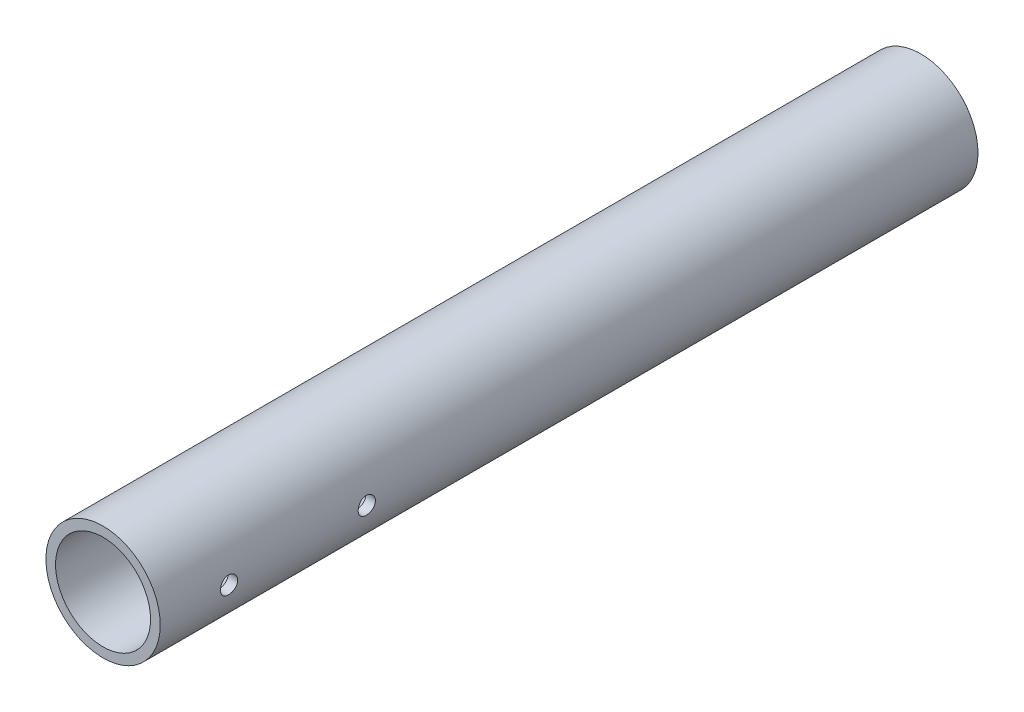
ISO-10303-21;
HEADER;
FILE_DESCRIPTION(('STEP AP214'),'2;1');
FILE_NAME('part.step','',(''),(''),'','','');
FILE_SCHEMA(('AUTOMOTIVE_DESIGN { 1 0 10303 214 1 1 1 1 }'));
ENDSEC;
DATA;
#1=APPLICATION_CONTEXT('core data for automotive mechanical design processes');
#2=APPLICATION_PROTOCOL_DEFINITION('international standard','automotive_design',2000,#1);
#3=PRODUCT_CONTEXT('',#1,'mechanical');
#4=PRODUCT('Part','Part','',(#3));
#5=PRODUCT_RELATED_PRODUCT_CATEGORY('part','',(#4));
#6=PRODUCT_DEFINITION_FORMATION('','',#4);
#7=PRODUCT_DEFINITION_CONTEXT('part definition',#1,'design');
#8=PRODUCT_DEFINITION('design','',#6,#7);
#9=PRODUCT_DEFINITION_SHAPE('','',#8);
#10=(LENGTH_UNIT() NAMED_UNIT(*) SI_UNIT(.MILLI.,.METRE.));
#11=(NAMED_UNIT(*) PLANE_ANGLE_UNIT() SI_UNIT($,.RADIAN.));
#12=(NAMED_UNIT(*) SI_UNIT($,.STERADIAN.) SOLID_ANGLE_UNIT());
#13=UNCERTAINTY_MEASURE_WITH_UNIT(LENGTH_MEASURE(1.E-05),#10,'distance_accuracy_value','');
#14=(GEOMETRIC_REPRESENTATION_CONTEXT(3) GLOBAL_UNCERTAINTY_ASSIGNED_CONTEXT((#13)) GLOBAL_UNIT_ASSIGNED_CONTEXT((#10,
#11,#12)) REPRESENTATION_CONTEXT('',''));
#15=CARTESIAN_POINT('',(0.,0.,0.));
#16=DIRECTION('',(0.,0.,1.));
#17=DIRECTION('',(1.,0.,0.));
#18=AXIS2_PLACEMENT_3D('',#15,#16,#17);
#19=CARTESIAN_POINT('',(0.,0.,0.));
#20=DIRECTION('',(0.,0.,1.));
#21=DIRECTION('',(1.,0.,0.));
#22=AXIS2_PLACEMENT_3D('',#19,#20,#21);
#23=CYLINDRICAL_SURFACE('',#22,17.526);
#24=CARTESIAN_POINT('',(0.,0.,301.625));
#25=DIRECTION('',(0.,0.,1.));
#26=DIRECTION('',(1.,0.,0.));
#27=AXIS2_PLACEMENT_3D('',#24,#25,#26);
#28=CIRCLE('',#27,17.526);
#29=CARTESIAN_POINT('',(17.526,0.,301.625));
#30=VERTEX_POINT('',#29);
#31=EDGE_CURVE('E19',#30,#30,#28,.F.);
#32=ORIENTED_EDGE('',*,*,#31,.F.);
#33=EDGE_LOOP('',(#32));
#34=FACE_BOUND('',#33,.T.);
#35=CARTESIAN_POINT('',(0.,0.,0.));
#36=DIRECTION('',(0.,0.,1.));
#37=DIRECTION('',(1.,0.,0.));
#38=AXIS2_PLACEMENT_3D('',#35,#36,#37);
#39=CIRCLE('',#38,17.526);
#40=CARTESIAN_POINT('',(17.526,0.,0.));
#41=VERTEX_POINT('',#40);
#42=EDGE_CURVE('E79',#41,#41,#39,.F.);
#43=ORIENTED_EDGE('',*,*,#42,.T.);
#44=EDGE_LOOP('',(#43));
#45=FACE_BOUND('',#44,.T.);
#46=CARTESIAN_POINT('',(17.526,0.,228.6));
#47=CARTESIAN_POINT('',(17.5259963175726,-0.176613181051219,228.599991723302));
#48=CARTESIAN_POINT('',(17.5233002826582,-0.353449171258822,228.585200668148));
#49=CARTESIAN_POINT('',(17.5127973362593,-0.702281908474058,228.526423100833));
#50=CARTESIAN_POINT('',(17.5049801575711,-0.874268208471729,228.482377935658));
#51=CARTESIAN_POINT('',(17.48511038614,-1.20810250721724,228.36647464681));
#52=CARTESIAN_POINT('',(17.473063368271,-1.36996352173553,228.294653119444));
#53=CARTESIAN_POINT('',(17.4460554580361,-1.67927316437238,228.125324943954));
#54=CARTESIAN_POINT('',(17.4310956012814,-1.82672688686375,228.027827420172));
#55=CARTESIAN_POINT('',(17.3997238299546,-2.10477719057218,227.808732397024));
#56=CARTESIAN_POINT('',(17.3832987194985,-2.23518750324315,227.686900352404));
#57=CARTESIAN_POINT('',(17.3509459564745,-2.4738411468331,227.42309368207));
#58=CARTESIAN_POINT('',(17.335018364459,-2.58208178835294,227.281116616098));
#59=CARTESIAN_POINT('',(17.3053385875312,-2.77407123838613,226.979766903282));
#60=CARTESIAN_POINT('',(17.2916032051447,-2.85763469507356,226.820274368621));
#61=CARTESIAN_POINT('',(17.2680458993697,-2.99671051245856,226.489226026226));
#62=CARTESIAN_POINT('',(17.2582236283197,-3.05222536525873,226.317671291755));
#63=CARTESIAN_POINT('',(17.2437354897132,-3.13304106760211,225.969333560972));
#64=CARTESIAN_POINT('',(17.2390149777777,-3.15866234519934,225.792627222411));
#65=CARTESIAN_POINT('',(17.2350999262051,-3.17995782709564,225.437365293601));
#66=CARTESIAN_POINT('',(17.2359049331653,-3.17563448853508,225.258809856282));
#67=CARTESIAN_POINT('',(17.2429001543548,-3.1374237379337,224.907230746528));
#68=CARTESIAN_POINT('',(17.2490242048828,-3.10389954139064,224.734166088615));
#69=CARTESIAN_POINT('',(17.2658637551246,-3.00880960849843,224.396157532169));
#70=CARTESIAN_POINT('',(17.276579474651,-2.94724252966899,224.231214022834));
#71=CARTESIAN_POINT('',(17.3014652665684,-2.79745291276664,223.913055892979));
#72=CARTESIAN_POINT('',(17.3156545368537,-2.70908155858375,223.759912899375));
#73=CARTESIAN_POINT('',(17.3458743890737,-2.50830442996258,223.470503775616));
#74=CARTESIAN_POINT('',(17.3619050065012,-2.39589819220294,223.334237970883));
#75=CARTESIAN_POINT('',(17.3942883351767,-2.1482992811474,223.080361728415));
#76=CARTESIAN_POINT('',(17.4106423451863,-2.01279967929527,222.963050627084));
#77=CARTESIAN_POINT('',(17.4416233292778,-1.72381393754222,222.752729015706));
#78=CARTESIAN_POINT('',(17.4562495353168,-1.57031985869495,222.65972929043));
#79=CARTESIAN_POINT('',(17.4821550853628,-1.24935860544025,222.50063859958));
#80=CARTESIAN_POINT('',(17.4934280108005,-1.08186540977742,222.434599150311));
#81=CARTESIAN_POINT('',(17.5112904348231,-0.738132155126084,222.331807400917));
#82=CARTESIAN_POINT('',(17.5178897862262,-0.561911340494511,222.294993467668));
#83=CARTESIAN_POINT('',(17.5231896350432,-0.320322833927912,222.265545032544));
#84=CARTESIAN_POINT('',(17.5242412276541,-0.256410066392401,222.259720466382));
#85=CARTESIAN_POINT('',(17.5256470796399,-0.128341342038199,222.251946444097));
#86=CARTESIAN_POINT('',(17.5260013382808,-0.0641853849635993,222.249996992053));
#87=CARTESIAN_POINT('',(17.5259963175725,0.176613181051216,222.250008276698));
#88=CARTESIAN_POINT('',(17.5233002826582,0.35344917125882,222.264799331852));
#89=CARTESIAN_POINT('',(17.5127973362593,0.702281908474057,222.323576899167));
#90=CARTESIAN_POINT('',(17.5049801575711,0.874268208471726,222.367622064342));
#91=CARTESIAN_POINT('',(17.48511038614,1.20810250721724,222.48352535319));
#92=CARTESIAN_POINT('',(17.473063368271,1.36996352173553,222.555346880556));
#93=CARTESIAN_POINT('',(17.4460554580361,1.67927316437238,222.724675056046));
#94=CARTESIAN_POINT('',(17.4310956012814,1.82672688686375,222.822172579828));
#95=CARTESIAN_POINT('',(17.3997238299546,2.10477719057218,223.041267602976));
#96=CARTESIAN_POINT('',(17.3832987194985,2.23518750324315,223.163099647596));
#97=CARTESIAN_POINT('',(17.3509459564745,2.4738411468331,223.42690631793));
#98=CARTESIAN_POINT('',(17.335018364459,2.58208178835294,223.568883383902));
#99=CARTESIAN_POINT('',(17.3053385875312,2.77407123838613,223.870233096717));
#100=CARTESIAN_POINT('',(17.2916032051447,2.85763469507356,224.029725631379));
#101=CARTESIAN_POINT('',(17.2680458993697,2.99671051245856,224.360773973774));
#102=CARTESIAN_POINT('',(17.2582236283197,3.05222536525873,224.532328708245));
#103=CARTESIAN_POINT('',(17.2437354897132,3.13304106760212,224.880666439028));
#104=CARTESIAN_POINT('',(17.2390149777777,3.15866234519934,225.057372777589));
#105=CARTESIAN_POINT('',(17.2350999262051,3.17995782709564,225.412634706399));
#106=CARTESIAN_POINT('',(17.2359049331653,3.17563448853508,225.591190143718));
#107=CARTESIAN_POINT('',(17.2429001543548,3.1374237379337,225.942769253472));
#108=CARTESIAN_POINT('',(17.2490242048828,3.10389954139064,226.115833911385));
#109=CARTESIAN_POINT('',(17.2658637551246,3.00880960849843,226.453842467831));
#110=CARTESIAN_POINT('',(17.276579474651,2.94724252966899,226.618785977166));
#111=CARTESIAN_POINT('',(17.3014652665683,2.79745291276665,226.936944107021));
#112=CARTESIAN_POINT('',(17.3156545368537,2.70908155858377,227.090087100625));
#113=CARTESIAN_POINT('',(17.3458743890737,2.50830442996262,227.379496224384));
#114=CARTESIAN_POINT('',(17.3619050065012,2.39589819220297,227.515762029117));
#115=CARTESIAN_POINT('',(17.3942883351767,2.14829928114741,227.769638271585));
#116=CARTESIAN_POINT('',(17.4106423451863,2.01279967929527,227.886949372916));
#117=CARTESIAN_POINT('',(17.4416233292778,1.72381393754221,228.097270984294));
#118=CARTESIAN_POINT('',(17.4562495353168,1.57031985869494,228.19027070957));
#119=CARTESIAN_POINT('',(17.4821550853628,1.24935860544024,228.34936140042));
#120=CARTESIAN_POINT('',(17.4934280108005,1.08186540977741,228.415400849689));
#121=CARTESIAN_POINT('',(17.5112904348231,0.738132155126082,228.518192599083));
#122=CARTESIAN_POINT('',(17.5178897862262,0.56191134049451,228.555006532332));
#123=CARTESIAN_POINT('',(17.5231896350432,0.320322833927913,228.584454967456));
#124=CARTESIAN_POINT('',(17.5242412276541,0.256410066392403,228.590279533618));
#125=CARTESIAN_POINT('',(17.5256470796399,0.128341342038199,228.598053555903));
#126=CARTESIAN_POINT('',(17.5260013382808,0.064185384963597,228.600003007947));
#127=CARTESIAN_POINT('',(17.526,0.,228.6));
#128=B_SPLINE_CURVE_WITH_KNOTS('',3,(#46,#47,#48,#49,#50,#51,#52,#53,#54,#55,#56,#57,#58,#59,
#60,#61,#62,#63,#64,#65,#66,#67,#68,#69,#70,#71,#72,#73,#74,#75,#76,#77,#78,#79,#80,#81,#82,#83,
#84,#85,#86,#87,#88,#89,#90,#91,#92,#93,#94,#95,#96,#97,#98,#99,#100,#101,#102,#103,#104,#105,
#106,#107,#108,#109,#110,#111,#112,#113,#114,#115,#116,#117,#118,#119,#120,#121,#122,#123,#124,
#125,#126,#127),.UNSPECIFIED.,.T.,.F.,(4,2,2,2,2,2,2,2,2,2,2,2,2,2,2,2,2,2,2,2,2,2,2,2,2,2,2,2,
2,2,2,2,2,2,2,2,2,2,2,2,4),(0.,0.529594384353563,1.06025379692028,1.59021641642846,
2.11999095947089,2.65514211392808,3.19035814908344,3.72949754433928,4.26858902893713,
4.80184732449043,5.33506186343175,5.86173721299806,6.38843777843187,6.91811781643,
7.44780806601112,7.98518312810166,8.52279617220151,9.06143174460419,9.59892835876538,
9.79139521459188,9.98386227300716,10.5134566573607,11.0441160699274,11.5740786894356,
12.103853232478,12.6390043869352,13.1742204220906,13.7133598173464,14.2524513019443,
14.7857095974976,15.3189241364389,15.8455994860052,16.372300051439,16.9019800894371,
17.4316703390183,17.9690454011088,18.5066584452087,19.0452940176114,19.5827906317725,
19.775257487599,19.9677245460143),.UNSPECIFIED.);
#129=CARTESIAN_POINT('',(17.526,0.,228.6));
#130=VERTEX_POINT('',#129);
#131=EDGE_CURVE('E73',#130,#130,#128,.T.);
#132=ORIENTED_EDGE('',*,*,#131,.T.);
#133=EDGE_LOOP('',(#132));
#134=FACE_BOUND('',#133,.T.);
#135=CARTESIAN_POINT('',(17.526,0.,279.4));
#136=CARTESIAN_POINT('',(17.5259963175726,-0.176613181051217,279.399991723302));
#137=CARTESIAN_POINT('',(17.5233002826582,-0.353449171258817,279.385200668148));
#138=CARTESIAN_POINT('',(17.5127973362593,-0.702281908474051,279.326423100833));
#139=CARTESIAN_POINT('',(17.5049801575711,-0.874268208471723,279.282377935658));
#140=CARTESIAN_POINT('',(17.48511038614,-1.20810250721723,279.16647464681));
#141=CARTESIAN_POINT('',(17.473063368271,-1.36996352173552,279.094653119444));
#142=CARTESIAN_POINT('',(17.4460554580361,-1.67927316437237,278.925324943954));
#143=CARTESIAN_POINT('',(17.4310956012814,-1.82672688686375,278.827827420172));
#144=CARTESIAN_POINT('',(17.3997238299546,-2.10477719057218,278.608732397024));
#145=CARTESIAN_POINT('',(17.3832987194985,-2.23518750324315,278.486900352404));
#146=CARTESIAN_POINT('',(17.3509459564745,-2.4738411468331,278.22309368207));
#147=CARTESIAN_POINT('',(17.335018364459,-2.58208178835293,278.081116616098));
#148=CARTESIAN_POINT('',(17.3053385875312,-2.77407123838613,277.779766903283));
#149=CARTESIAN_POINT('',(17.2916032051447,-2.85763469507356,277.620274368621));
#150=CARTESIAN_POINT('',(17.2680458993697,-2.99671051245855,277.289226026226));
#151=CARTESIAN_POINT('',(17.2582236283197,-3.05222536525872,277.117671291755));
#152=CARTESIAN_POINT('',(17.2437354897132,-3.13304106760211,276.769333560972));
#153=CARTESIAN_POINT('',(17.2390149777777,-3.15866234519934,276.592627222411));
#154=CARTESIAN_POINT('',(17.2350999262051,-3.17995782709565,276.237365293601));
#155=CARTESIAN_POINT('',(17.2359049331653,-3.17563448853508,276.058809856282));
#156=CARTESIAN_POINT('',(17.2429001543548,-3.13742373793371,275.707230746528));
#157=CARTESIAN_POINT('',(17.2490242048828,-3.10389954139064,275.534166088615));
#158=CARTESIAN_POINT('',(17.2658637551246,-3.00880960849844,275.196157532169));
#159=CARTESIAN_POINT('',(17.276579474651,-2.947242529669,275.031214022834));
#160=CARTESIAN_POINT('',(17.3014652665683,-2.79745291276668,274.713055892979));
#161=CARTESIAN_POINT('',(17.3156545368537,-2.70908155858381,274.559912899375));
#162=CARTESIAN_POINT('',(17.3458743890737,-2.50830442996264,274.270503775616));
#163=CARTESIAN_POINT('',(17.3619050065012,-2.39589819220297,274.134237970883));
#164=CARTESIAN_POINT('',(17.3942883351767,-2.14829928114741,273.880361728415));
#165=CARTESIAN_POINT('',(17.4106423451863,-2.01279967929529,273.763050627084));
#166=CARTESIAN_POINT('',(17.4416233292778,-1.72381393754225,273.552729015706));
#167=CARTESIAN_POINT('',(17.4562495353167,-1.57031985869497,273.45972929043));
#168=CARTESIAN_POINT('',(17.4821550853627,-1.24935860544027,273.30063859958));
#169=CARTESIAN_POINT('',(17.4934280108005,-1.08186540977745,273.234599150311));
#170=CARTESIAN_POINT('',(17.5112904348231,-0.738132155126105,273.131807400917));
#171=CARTESIAN_POINT('',(17.5178897862262,-0.561911340494518,273.094993467668));
#172=CARTESIAN_POINT('',(17.5231896350432,-0.320322833927917,273.065545032544));
#173=CARTESIAN_POINT('',(17.5242412276541,-0.256410066392408,273.059720466382));
#174=CARTESIAN_POINT('',(17.5256470796399,-0.128341342038205,273.051946444097));
#175=CARTESIAN_POINT('',(17.5260013382808,-0.0641853849636042,273.049996992053));
#176=CARTESIAN_POINT('',(17.5259963175725,0.176613181051215,273.050008276698));
#177=CARTESIAN_POINT('',(17.5233002826582,0.353449171258822,273.064799331852));
#178=CARTESIAN_POINT('',(17.5127973362593,0.702281908474058,273.123576899167));
#179=CARTESIAN_POINT('',(17.5049801575711,0.874268208471724,273.167622064342));
#180=CARTESIAN_POINT('',(17.48511038614,1.20810250721723,273.28352535319));
#181=CARTESIAN_POINT('',(17.473063368271,1.36996352173552,273.355346880556));
#182=CARTESIAN_POINT('',(17.4460554580361,1.67927316437237,273.524675056046));
#183=CARTESIAN_POINT('',(17.4310956012814,1.82672688686375,273.622172579828));
#184=CARTESIAN_POINT('',(17.3997238299546,2.10477719057218,273.841267602976));
#185=CARTESIAN_POINT('',(17.3832987194985,2.23518750324315,273.963099647596));
#186=CARTESIAN_POINT('',(17.3509459564745,2.4738411468331,274.22690631793));
#187=CARTESIAN_POINT('',(17.335018364459,2.58208178835293,274.368883383902));
#188=CARTESIAN_POINT('',(17.3053385875312,2.77407123838613,274.670233096717));
#189=CARTESIAN_POINT('',(17.2916032051447,2.85763469507356,274.829725631379));
#190=CARTESIAN_POINT('',(17.2680458993697,2.99671051245855,275.160773973774));
#191=CARTESIAN_POINT('',(17.2582236283197,3.05222536525872,275.332328708245));
#192=CARTESIAN_POINT('',(17.2437354897132,3.13304106760211,275.680666439028));
#193=CARTESIAN_POINT('',(17.2390149777777,3.15866234519934,275.857372777589));
#194=CARTESIAN_POINT('',(17.2350999262051,3.17995782709565,276.212634706399));
#195=CARTESIAN_POINT('',(17.2359049331653,3.17563448853508,276.391190143718));
#196=CARTESIAN_POINT('',(17.2429001543548,3.13742373793371,276.742769253472));
#197=CARTESIAN_POINT('',(17.2490242048828,3.10389954139064,276.915833911385));
#198=CARTESIAN_POINT('',(17.2658637551246,3.00880960849844,277.253842467831));
#199=CARTESIAN_POINT('',(17.276579474651,2.947242529669,277.418785977166));
#200=CARTESIAN_POINT('',(17.3014652665683,2.79745291276668,277.736944107021));
#201=CARTESIAN_POINT('',(17.3156545368537,2.70908155858381,277.890087100625));
#202=CARTESIAN_POINT('',(17.3458743890737,2.50830442996264,278.179496224384));
#203=CARTESIAN_POINT('',(17.3619050065012,2.39589819220297,278.315762029117));
#204=CARTESIAN_POINT('',(17.3942883351767,2.14829928114741,278.569638271585));
#205=CARTESIAN_POINT('',(17.4106423451863,2.01279967929529,278.686949372916));
#206=CARTESIAN_POINT('',(17.4416233292778,1.72381393754225,278.897270984294));
#207=CARTESIAN_POINT('',(17.4562495353167,1.57031985869498,278.99027070957));
#208=CARTESIAN_POINT('',(17.4821550853627,1.24935860544028,279.14936140042));
#209=CARTESIAN_POINT('',(17.4934280108005,1.08186540977744,279.215400849689));
#210=CARTESIAN_POINT('',(17.5112904348231,0.738132155126103,279.318192599083));
#211=CARTESIAN_POINT('',(17.5178897862262,0.561911340494523,279.355006532332));
#212=CARTESIAN_POINT('',(17.5231896350432,0.320322833927918,279.384454967456));
#213=CARTESIAN_POINT('',(17.5242412276541,0.256410066392406,279.390279533618));
#214=CARTESIAN_POINT('',(17.5256470796399,0.1283413420382,279.398053555903));
#215=CARTESIAN_POINT('',(17.5260013382808,0.0641853849635972,279.400003007947));
#216=CARTESIAN_POINT('',(17.526,0.,279.4));
#217=B_SPLINE_CURVE_WITH_KNOTS('',3,(#135,#136,#137,#138,#139,#140,#141,#142,#143,#144,#145,
#146,#147,#148,#149,#150,#151,#152,#153,#154,#155,#156,#157,#158,#159,#160,#161,#162,#163,#164,
#165,#166,#167,#168,#169,#170,#171,#172,#173,#174,#175,#176,#177,#178,#179,#180,#181,#182,#183,
#184,#185,#186,#187,#188,#189,#190,#191,#192,#193,#194,#195,#196,#197,#198,#199,#200,#201,#202,
#203,#204,#205,#206,#207,#208,#209,#210,#211,#212,#213,#214,#215,#216),.UNSPECIFIED.,.T.,.F.,(4,
2,2,2,2,2,2,2,2,2,2,2,2,2,2,2,2,2,2,2,2,2,2,2,2,2,2,2,2,2,2,2,2,2,2,2,2,2,2,2,4),(0.,
0.529594384353553,1.06025379692027,1.59021641642847,2.11999095947089,2.6551421139281,
3.19035814908337,3.72949754433927,4.26858902893715,4.80184732449042,5.33506186343168,
5.86173721299802,6.38843777843179,6.91811781642991,7.44780806601106,7.98518312810164,
8.52279617220147,9.06143174460417,9.59892835876537,9.79139521459187,9.98386227300715,
10.5134566573607,11.0441160699274,11.5740786894356,12.103853232478,12.6390043869353,
13.1742204220905,13.7133598173464,14.2524513019443,14.7857095974976,15.3189241364388,
15.8455994860052,16.372300051439,16.9019800894371,17.4316703390182,17.9690454011088,
18.5066584452086,19.0452940176113,19.5827906317725,19.775257487599,19.9677245460143),.UNSPECIFIED.);
#218=CARTESIAN_POINT('',(17.526,0.,279.4));
#219=VERTEX_POINT('',#218);
#220=EDGE_CURVE('E78',#219,#219,#217,.T.);
#221=ORIENTED_EDGE('',*,*,#220,.T.);
#222=EDGE_LOOP('',(#221));
#223=FACE_BOUND('',#222,.T.);
#224=ADVANCED_FACE('F15',(#34,#45,#134,#223),#23,.F.);
#225=CARTESIAN_POINT('',(0.,0.,301.625));
#226=DIRECTION('',(0.,0.,1.));
#227=DIRECTION('',(1.,0.,0.));
#228=AXIS2_PLACEMENT_3D('',#225,#226,#227);
#229=PLANE('',#228);
#230=ORIENTED_EDGE('',*,*,#31,.T.);
#231=EDGE_LOOP('',(#230));
#232=FACE_BOUND('',#231,.T.);
#233=CARTESIAN_POINT('',(0.,0.,301.625));
#234=DIRECTION('',(0.,0.,1.));
#235=DIRECTION('',(1.,0.,0.));
#236=AXIS2_PLACEMENT_3D('',#233,#234,#235);
#237=CIRCLE('',#236,21.082);
#238=CARTESIAN_POINT('',(21.082,0.,301.625));
#239=VERTEX_POINT('',#238);
#240=EDGE_CURVE('E54',#239,#239,#237,.F.);
#241=ORIENTED_EDGE('',*,*,#240,.F.);
#242=EDGE_LOOP('',(#241));
#243=FACE_BOUND('',#242,.T.);
#244=ADVANCED_FACE('F66',(#232,#243),#229,.T.);
#245=CARTESIAN_POINT('',(0.,0.,0.));
#246=DIRECTION('',(0.,0.,1.));
#247=DIRECTION('',(1.,0.,0.));
#248=AXIS2_PLACEMENT_3D('',#245,#246,#247);
#249=PLANE('',#248);
#250=ORIENTED_EDGE('',*,*,#42,.F.);
#251=EDGE_LOOP('',(#250));
#252=FACE_BOUND('',#251,.T.);
#253=CARTESIAN_POINT('',(0.,0.,0.));
#254=DIRECTION('',(0.,0.,1.));
#255=DIRECTION('',(1.,0.,0.));
#256=AXIS2_PLACEMENT_3D('',#253,#254,#255);
#257=CIRCLE('',#256,21.082);
#258=CARTESIAN_POINT('',(21.082,0.,0.));
#259=VERTEX_POINT('',#258);
#260=EDGE_CURVE('E28',#259,#259,#257,.T.);
#261=ORIENTED_EDGE('',*,*,#260,.F.);
#262=EDGE_LOOP('',(#261));
#263=FACE_BOUND('',#262,.T.);
#264=ADVANCED_FACE('F61',(#252,#263),#249,.F.);
#265=CARTESIAN_POINT('',(0.,0.,225.425));
#266=DIRECTION('',(1.,0.,0.));
#267=DIRECTION('',(0.,0.,-1.));
#268=AXIS2_PLACEMENT_3D('',#265,#266,#267);
#269=CYLINDRICAL_SURFACE('',#268,3.175);
#270=ORIENTED_EDGE('',*,*,#131,.F.);
#271=EDGE_LOOP('',(#270));
#272=FACE_BOUND('',#271,.T.);
#273=CARTESIAN_POINT('',(21.082,0.,222.25));
#274=CARTESIAN_POINT('',(21.08199697693,-0.177096882326681,222.250008010368));
#275=CARTESIAN_POINT('',(21.0797432371457,-0.354422246181486,222.26487962863));
#276=CARTESIAN_POINT('',(21.0709639947796,-0.704244999090061,222.323992357156));
#277=CARTESIAN_POINT('',(21.0644297330762,-0.876731730624422,222.368293691309));
#278=CARTESIAN_POINT('',(21.0478236267626,-1.21157212719879,222.484916576821));
#279=CARTESIAN_POINT('',(21.0377559284511,-1.37393740737855,222.557205296689));
#280=CARTESIAN_POINT('',(21.0151978427835,-1.68416250683157,222.727677911167));
#281=CARTESIAN_POINT('',(21.0027084021292,-1.83202796044268,222.825851692226));
#282=CARTESIAN_POINT('',(20.9765823177096,-2.11031247055376,223.046151374218));
#283=CARTESIAN_POINT('',(20.9629381187472,-2.24059940402081,223.168443308759));
#284=CARTESIAN_POINT('',(20.9360989041358,-2.4788913097797,223.43315612125));
#285=CARTESIAN_POINT('',(20.9229039374157,-2.58689386136821,223.57557918317));
#286=CARTESIAN_POINT('',(20.8983859370743,-2.77804880392724,223.877379318754));
#287=CARTESIAN_POINT('',(20.8870724896658,-2.86107558124535,224.03683680048));
#288=CARTESIAN_POINT('',(20.8676999734321,-2.99911832257812,224.367631067207));
#289=CARTESIAN_POINT('',(20.8596406975045,-3.05413606920678,224.538967095418));
#290=CARTESIAN_POINT('',(20.8477621063255,-3.13419546665349,224.887286214704));
#291=CARTESIAN_POINT('',(20.8439112642446,-3.15946012056009,225.064216954801));
#292=CARTESIAN_POINT('',(20.8407898414214,-3.17998700169885,225.419845640065));
#293=CARTESIAN_POINT('',(20.8415190033561,-3.17525091449293,225.598543485386));
#294=CARTESIAN_POINT('',(20.8474463650272,-3.13609305999255,225.951055967361));
#295=CARTESIAN_POINT('',(20.8526071214054,-3.10192000349508,226.124898951723));
#296=CARTESIAN_POINT('',(20.8667577563942,-3.00524711666564,226.464356569077));
#297=CARTESIAN_POINT('',(20.8757477764901,-2.94274623965999,226.62997089778));
#298=CARTESIAN_POINT('',(20.8965856584325,-2.79093104974241,226.949029881479));
#299=CARTESIAN_POINT('',(20.9084447970673,-2.70151058452644,227.102423259963));
#300=CARTESIAN_POINT('',(20.9336753486097,-2.49847766149162,227.392109939396));
#301=CARTESIAN_POINT('',(20.9470467424824,-2.3848655081586,227.528403455536));
#302=CARTESIAN_POINT('',(20.9739588701191,-2.13533197536228,227.781452795665));
#303=CARTESIAN_POINT('',(20.9874999699534,-1.99920089823695,227.89800187002));
#304=CARTESIAN_POINT('',(21.0131093792406,-1.70912894954015,228.106684321995));
#305=CARTESIAN_POINT('',(21.0251770223332,-1.55518008085437,228.198806674708));
#306=CARTESIAN_POINT('',(21.0464937025039,-1.23362225418931,228.356023003482));
#307=CARTESIAN_POINT('',(21.0557387492241,-1.06599437803163,228.421078761652));
#308=CARTESIAN_POINT('',(21.0703231912675,-0.722245530020102,228.521925293116));
#309=CARTESIAN_POINT('',(21.0756708320201,-0.546143333577576,228.557777868268));
#310=CARTESIAN_POINT('',(21.0798495375515,-0.307328662833132,228.585693304996));
#311=CARTESIAN_POINT('',(21.0806542771979,-0.245995981253088,228.591054107026));
#312=CARTESIAN_POINT('',(21.0817300341182,-0.12311807286592,228.598208848164));
#313=CARTESIAN_POINT('',(21.0820010510576,-0.0615728459255779,228.600002785036));
#314=CARTESIAN_POINT('',(21.08199697693,0.177096882326674,228.599991989632));
#315=CARTESIAN_POINT('',(21.0797432371457,0.354422246181477,228.58512037137));
#316=CARTESIAN_POINT('',(21.0709639947796,0.704244999090053,228.526007642844));
#317=CARTESIAN_POINT('',(21.0644297330762,0.876731730624415,228.481706308691));
#318=CARTESIAN_POINT('',(21.0478236267626,1.21157212719878,228.365083423179));
#319=CARTESIAN_POINT('',(21.0377559284511,1.37393740737854,228.292794703311));
#320=CARTESIAN_POINT('',(21.0151978427835,1.68416250683156,228.122322088833));
#321=CARTESIAN_POINT('',(21.0027084021292,1.83202796044268,228.024148307774));
#322=CARTESIAN_POINT('',(20.9765823177096,2.11031247055375,227.803848625782));
#323=CARTESIAN_POINT('',(20.9629381187472,2.2405994040208,227.681556691241));
#324=CARTESIAN_POINT('',(20.9360989041358,2.47889130977969,227.41684387875));
#325=CARTESIAN_POINT('',(20.9229039374157,2.5868938613682,227.27442081683));
#326=CARTESIAN_POINT('',(20.8983859370743,2.77804880392722,226.972620681246));
#327=CARTESIAN_POINT('',(20.8870724896658,2.86107558124534,226.81316319952));
#328=CARTESIAN_POINT('',(20.8676999734321,2.99911832257811,226.482368932793));
#329=CARTESIAN_POINT('',(20.8596406975045,3.05413606920678,226.311032904582));
#330=CARTESIAN_POINT('',(20.8477621063255,3.13419546665349,225.962713785296));
#331=CARTESIAN_POINT('',(20.8439112642446,3.15946012056009,225.785783045199));
#332=CARTESIAN_POINT('',(20.8407898414214,3.17998700169885,225.430154359935));
#333=CARTESIAN_POINT('',(20.8415190033561,3.17525091449293,225.251456514614));
#334=CARTESIAN_POINT('',(20.8474463650272,3.13609305999255,224.898944032639));
#335=CARTESIAN_POINT('',(20.8526071214054,3.10192000349508,224.725101048277));
#336=CARTESIAN_POINT('',(20.8667577563942,3.00524711666564,224.385643430923));
#337=CARTESIAN_POINT('',(20.8757477764901,2.94274623965999,224.22002910222));
#338=CARTESIAN_POINT('',(20.8965856584325,2.79093104974241,223.900970118521));
#339=CARTESIAN_POINT('',(20.9084447970673,2.70151058452644,223.747576740037));
#340=CARTESIAN_POINT('',(20.9336753486097,2.49847766149162,223.457890060604));
#341=CARTESIAN_POINT('',(20.9470467424824,2.3848655081586,223.321596544464));
#342=CARTESIAN_POINT('',(20.9739588701191,2.13533197536228,223.068547204335));
#343=CARTESIAN_POINT('',(20.9874999699534,1.99920089823695,222.95199812998));
#344=CARTESIAN_POINT('',(21.0131093792406,1.70912894954015,222.743315678005));
#345=CARTESIAN_POINT('',(21.0251770223332,1.55518008085437,222.651193325292));
#346=CARTESIAN_POINT('',(21.0464937025039,1.23362225418931,222.493976996518));
#347=CARTESIAN_POINT('',(21.0557387492241,1.06599437803164,222.428921238348));
#348=CARTESIAN_POINT('',(21.0703231912675,0.722245530020105,222.328074706884));
#349=CARTESIAN_POINT('',(21.0756708320201,0.546143333577579,222.292222131732));
#350=CARTESIAN_POINT('',(21.0798495375515,0.307328662833134,222.264306695004));
#351=CARTESIAN_POINT('',(21.0806542771979,0.245995981253089,222.258945892974));
#352=CARTESIAN_POINT('',(21.0817300341182,0.123118072865919,222.251791151836));
#353=CARTESIAN_POINT('',(21.0820010510576,0.0615728459255757,222.249997214964));
#354=CARTESIAN_POINT('',(21.082,0.,222.25));
#355=B_SPLINE_CURVE_WITH_KNOTS('',3,(#273,#274,#275,#276,#277,#278,#279,#280,#281,#282,#283,
#284,#285,#286,#287,#288,#289,#290,#291,#292,#293,#294,#295,#296,#297,#298,#299,#300,#301,#302,
#303,#304,#305,#306,#307,#308,#309,#310,#311,#312,#313,#314,#315,#316,#317,#318,#319,#320,#321,
#322,#323,#324,#325,#326,#327,#328,#329,#330,#331,#332,#333,#334,#335,#336,#337,#338,#339,#340,
#341,#342,#343,#344,#345,#346,#347,#348,#349,#350,#351,#352,#353,#354),.UNSPECIFIED.,.T.,.F.,(4,
2,2,2,2,2,2,2,2,2,2,2,2,2,2,2,2,2,2,2,2,2,2,2,2,2,2,2,2,2,2,2,2,2,2,2,2,2,2,2,4),(0.,
0.531055777943665,1.0632016503941,1.59472515452003,2.12604129410148,2.66115151001705,
3.19631982321002,3.73413637351617,4.27191869060599,4.80564407774994,5.33933947832749,
5.86856946465913,6.39781900689902,6.92918350732539,7.46054132019028,7.99715881916553,
8.53401810770141,9.07163288703761,9.60810694982832,9.79274371285329,9.97738059162621,
10.5084363695699,11.0405822420203,11.5721057461462,12.1034218857277,12.6385321016433,
13.1737004148362,13.7115169651423,14.2492992822322,14.7830246693762,15.3167200699537,
15.8459500562853,16.3751995985252,16.9065640989516,17.4379219118165,17.9745394107917,
18.5113986993276,19.0490134786638,19.5854875414545,19.7701243044795,19.9547611832524),.UNSPECIFIED.);
#356=CARTESIAN_POINT('',(21.082,0.,222.25));
#357=VERTEX_POINT('',#356);
#358=EDGE_CURVE('E23',#357,#357,#355,.T.);
#359=ORIENTED_EDGE('',*,*,#358,.F.);
#360=EDGE_LOOP('',(#359));
#361=FACE_BOUND('',#360,.T.);
#362=ADVANCED_FACE('F49',(#272,#361),#269,.F.);
#363=CARTESIAN_POINT('',(0.,0.,276.225));
#364=DIRECTION('',(1.,0.,0.));
#365=DIRECTION('',(0.,0.,-1.));
#366=AXIS2_PLACEMENT_3D('',#363,#364,#365);
#367=CYLINDRICAL_SURFACE('',#366,3.175);
#368=ORIENTED_EDGE('',*,*,#220,.F.);
#369=EDGE_LOOP('',(#368));
#370=FACE_BOUND('',#369,.T.);
#371=CARTESIAN_POINT('',(21.082,0.,273.05));
#372=CARTESIAN_POINT('',(21.08199697693,-0.17709688232668,273.050008010368));
#373=CARTESIAN_POINT('',(21.0797432371457,-0.354422246181484,273.06487962863));
#374=CARTESIAN_POINT('',(21.0709639947796,-0.704244999090057,273.123992357156));
#375=CARTESIAN_POINT('',(21.0644297330762,-0.876731730624416,273.168293691309));
#376=CARTESIAN_POINT('',(21.0478236267626,-1.21157212719878,273.284916576821));
#377=CARTESIAN_POINT('',(21.0377559284511,-1.37393740737854,273.357205296689));
#378=CARTESIAN_POINT('',(21.0151978427835,-1.68416250683155,273.527677911167));
#379=CARTESIAN_POINT('',(21.0027084021292,-1.83202796044267,273.625851692226));
#380=CARTESIAN_POINT('',(20.9765823177096,-2.11031247055373,273.846151374218));
#381=CARTESIAN_POINT('',(20.9629381187472,-2.24059940402077,273.968443308759));
#382=CARTESIAN_POINT('',(20.9360989041358,-2.47889130977967,274.23315612125));
#383=CARTESIAN_POINT('',(20.9229039374157,-2.58689386136818,274.37557918317));
#384=CARTESIAN_POINT('',(20.8983859370743,-2.77804880392722,274.677379318754));
#385=CARTESIAN_POINT('',(20.8870724896658,-2.86107558124533,274.83683680048));
#386=CARTESIAN_POINT('',(20.8676999734321,-2.99911832257811,275.167631067207));
#387=CARTESIAN_POINT('',(20.8596406975045,-3.05413606920677,275.338967095418));
#388=CARTESIAN_POINT('',(20.8477621063255,-3.13419546665348,275.687286214704));
#389=CARTESIAN_POINT('',(20.8439112642446,-3.15946012056009,275.864216954801));
#390=CARTESIAN_POINT('',(20.8407898414214,-3.17998700169885,276.219845640065));
#391=CARTESIAN_POINT('',(20.8415190033561,-3.17525091449293,276.398543485386));
#392=CARTESIAN_POINT('',(20.8474463650272,-3.13609305999255,276.751055967361));
#393=CARTESIAN_POINT('',(20.8526071214054,-3.10192000349509,276.924898951723));
#394=CARTESIAN_POINT('',(20.8667577563942,-3.00524711666565,277.264356569077));
#395=CARTESIAN_POINT('',(20.8757477764901,-2.94274623966,277.42997089778));
#396=CARTESIAN_POINT('',(20.8965856584325,-2.79093104974242,277.749029881479));
#397=CARTESIAN_POINT('',(20.9084447970673,-2.70151058452642,277.902423259963));
#398=CARTESIAN_POINT('',(20.9336753486097,-2.49847766149159,278.192109939396));
#399=CARTESIAN_POINT('',(20.9470467424824,-2.38486550815859,278.328403455536));
#400=CARTESIAN_POINT('',(20.9739588701191,-2.13533197536228,278.581452795665));
#401=CARTESIAN_POINT('',(20.9874999699534,-1.99920089823695,278.69800187002));
#402=CARTESIAN_POINT('',(21.0131093792406,-1.70912894954015,278.906684321995));
#403=CARTESIAN_POINT('',(21.0251770223332,-1.55518008085437,278.998806674708));
#404=CARTESIAN_POINT('',(21.0464937025039,-1.23362225418932,279.156023003482));
#405=CARTESIAN_POINT('',(21.0557387492241,-1.06599437803164,279.221078761652));
#406=CARTESIAN_POINT('',(21.0703231912675,-0.722245530020103,279.321925293116));
#407=CARTESIAN_POINT('',(21.0756708320201,-0.546143333577574,279.357777868268));
#408=CARTESIAN_POINT('',(21.0798495375515,-0.307328662833127,279.385693304996));
#409=CARTESIAN_POINT('',(21.0806542771979,-0.245995981253084,279.391054107026));
#410=CARTESIAN_POINT('',(21.0817300341182,-0.12311807286592,279.398208848164));
#411=CARTESIAN_POINT('',(21.0820010510576,-0.0615728459255789,279.400002785036));
#412=CARTESIAN_POINT('',(21.08199697693,0.177096882326675,279.399991989632));
#413=CARTESIAN_POINT('',(21.0797432371457,0.354422246181479,279.38512037137));
#414=CARTESIAN_POINT('',(21.0709639947796,0.704244999090053,279.326007642844));
#415=CARTESIAN_POINT('',(21.0644297330762,0.876731730624414,279.281706308691));
#416=CARTESIAN_POINT('',(21.0478236267626,1.21157212719877,279.165083423179));
#417=CARTESIAN_POINT('',(21.0377559284511,1.37393740737852,279.092794703311));
#418=CARTESIAN_POINT('',(21.0151978427835,1.68416250683153,278.922322088833));
#419=CARTESIAN_POINT('',(21.0027084021292,1.83202796044266,278.824148307773));
#420=CARTESIAN_POINT('',(20.9765823177096,2.11031247055373,278.603848625782));
#421=CARTESIAN_POINT('',(20.9629381187472,2.24059940402077,278.481556691241));
#422=CARTESIAN_POINT('',(20.9360989041358,2.47889130977966,278.21684387875));
#423=CARTESIAN_POINT('',(20.9229039374157,2.58689386136818,278.07442081683));
#424=CARTESIAN_POINT('',(20.8983859370743,2.77804880392721,277.772620681246));
#425=CARTESIAN_POINT('',(20.8870724896658,2.86107558124532,277.61316319952));
#426=CARTESIAN_POINT('',(20.8676999734321,2.9991183225781,277.282368932793));
#427=CARTESIAN_POINT('',(20.8596406975045,3.05413606920677,277.111032904582));
#428=CARTESIAN_POINT('',(20.8477621063255,3.13419546665348,276.762713785296));
#429=CARTESIAN_POINT('',(20.8439112642446,3.15946012056009,276.585783045199));
#430=CARTESIAN_POINT('',(20.8407898414214,3.17998700169885,276.230154359935));
#431=CARTESIAN_POINT('',(20.8415190033561,3.17525091449293,276.051456514614));
#432=CARTESIAN_POINT('',(20.8474463650272,3.13609305999255,275.698944032639));
#433=CARTESIAN_POINT('',(20.8526071214054,3.10192000349509,275.525101048277));
#434=CARTESIAN_POINT('',(20.8667577563942,3.00524711666566,275.185643430923));
#435=CARTESIAN_POINT('',(20.8757477764901,2.94274623966001,275.02002910222));
#436=CARTESIAN_POINT('',(20.8965856584325,2.79093104974243,274.700970118521));
#437=CARTESIAN_POINT('',(20.9084447970673,2.70151058452646,274.547576740037));
#438=CARTESIAN_POINT('',(20.9336753486097,2.49847766149166,274.257890060604));
#439=CARTESIAN_POINT('',(20.9470467424824,2.38486550815865,274.121596544464));
#440=CARTESIAN_POINT('',(20.9739588701191,2.13533197536231,273.868547204335));
#441=CARTESIAN_POINT('',(20.9874999699534,1.99920089823697,273.75199812998));
#442=CARTESIAN_POINT('',(21.0131093792406,1.70912894954014,273.543315678005));
#443=CARTESIAN_POINT('',(21.0251770223332,1.55518008085435,273.451193325292));
#444=CARTESIAN_POINT('',(21.0464937025039,1.23362225418928,273.293976996517));
#445=CARTESIAN_POINT('',(21.0557387492241,1.0659943780316,273.228921238348));
#446=CARTESIAN_POINT('',(21.0703231912676,0.722245530020078,273.128074706884));
#447=CARTESIAN_POINT('',(21.0756708320201,0.546143333577566,273.092222131732));
#448=CARTESIAN_POINT('',(21.0798495375515,0.307328662833132,273.064306695004));
#449=CARTESIAN_POINT('',(21.0806542771979,0.245995981253086,273.058945892974));
#450=CARTESIAN_POINT('',(21.0817300341182,0.123118072865918,273.051791151836));
#451=CARTESIAN_POINT('',(21.0820010510576,0.0615728459255751,273.049997214964));
#452=CARTESIAN_POINT('',(21.082,0.,273.05));
#453=B_SPLINE_CURVE_WITH_KNOTS('',3,(#371,#372,#373,#374,#375,#376,#377,#378,#379,#380,#381,
#382,#383,#384,#385,#386,#387,#388,#389,#390,#391,#392,#393,#394,#395,#396,#397,#398,#399,#400,
#401,#402,#403,#404,#405,#406,#407,#408,#409,#410,#411,#412,#413,#414,#415,#416,#417,#418,#419,
#420,#421,#422,#423,#424,#425,#426,#427,#428,#429,#430,#431,#432,#433,#434,#435,#436,#437,#438,
#439,#440,#441,#442,#443,#444,#445,#446,#447,#448,#449,#450,#451,#452),.UNSPECIFIED.,.T.,.F.,(4,
2,2,2,2,2,2,2,2,2,2,2,2,2,2,2,2,2,2,2,2,2,2,2,2,2,2,2,2,2,2,2,2,2,2,2,2,2,2,2,4),(0.,
0.53105577794366,1.06320165039409,1.59472515452001,2.12604129410146,2.66115151001699,
3.19631982320995,3.73413637351611,4.27191869060596,4.80564407774988,5.33933947832746,
5.86856946465915,6.39781900689901,6.9291835073254,7.46054132019028,7.99715881916551,
8.53401810770137,9.07163288703761,9.60810694982833,9.79274371285329,9.9773805916262,
10.5084363695699,11.0405822420203,11.5721057461462,12.1034218857277,12.6385321016432,
13.1737004148362,13.7115169651423,14.2492992822322,14.7830246693761,15.3167200699537,
15.8459500562853,16.3751995985252,16.9065640989515,17.4379219118164,17.9745394107917,
18.5113986993276,19.0490134786639,19.5854875414545,19.7701243044795,19.9547611832524),.UNSPECIFIED.);
#454=CARTESIAN_POINT('',(21.082,0.,273.05));
#455=VERTEX_POINT('',#454);
#456=EDGE_CURVE('E10',#455,#455,#453,.T.);
#457=ORIENTED_EDGE('',*,*,#456,.F.);
#458=EDGE_LOOP('',(#457));
#459=FACE_BOUND('',#458,.T.);
#460=ADVANCED_FACE('F38',(#370,#459),#367,.F.);
#461=CARTESIAN_POINT('',(0.,0.,0.));
#462=DIRECTION('',(0.,0.,1.));
#463=DIRECTION('',(1.,0.,0.));
#464=AXIS2_PLACEMENT_3D('',#461,#462,#463);
#465=CYLINDRICAL_SURFACE('',#464,21.082);
#466=ORIENTED_EDGE('',*,*,#240,.T.);
#467=EDGE_LOOP('',(#466));
#468=FACE_BOUND('',#467,.T.);
#469=ORIENTED_EDGE('',*,*,#260,.T.);
#470=EDGE_LOOP('',(#469));
#471=FACE_BOUND('',#470,.T.);
#472=ORIENTED_EDGE('',*,*,#358,.T.);
#473=EDGE_LOOP('',(#472));
#474=FACE_BOUND('',#473,.T.);
#475=ORIENTED_EDGE('',*,*,#456,.T.);
#476=EDGE_LOOP('',(#475));
#477=FACE_BOUND('',#476,.T.);
#478=ADVANCED_FACE('F40',(#468,#471,#474,#477),#465,.T.);
#479=CLOSED_SHELL('',(#224,#244,#264,#362,#460,#478));
#480=MANIFOLD_SOLID_BREP('B1',#479);
#481=ADVANCED_BREP_SHAPE_REPRESENTATION('',(#18,#480),#14);
#482=SHAPE_DEFINITION_REPRESENTATION(#9,#481);
ENDSEC;
END-ISO-10303-21;
